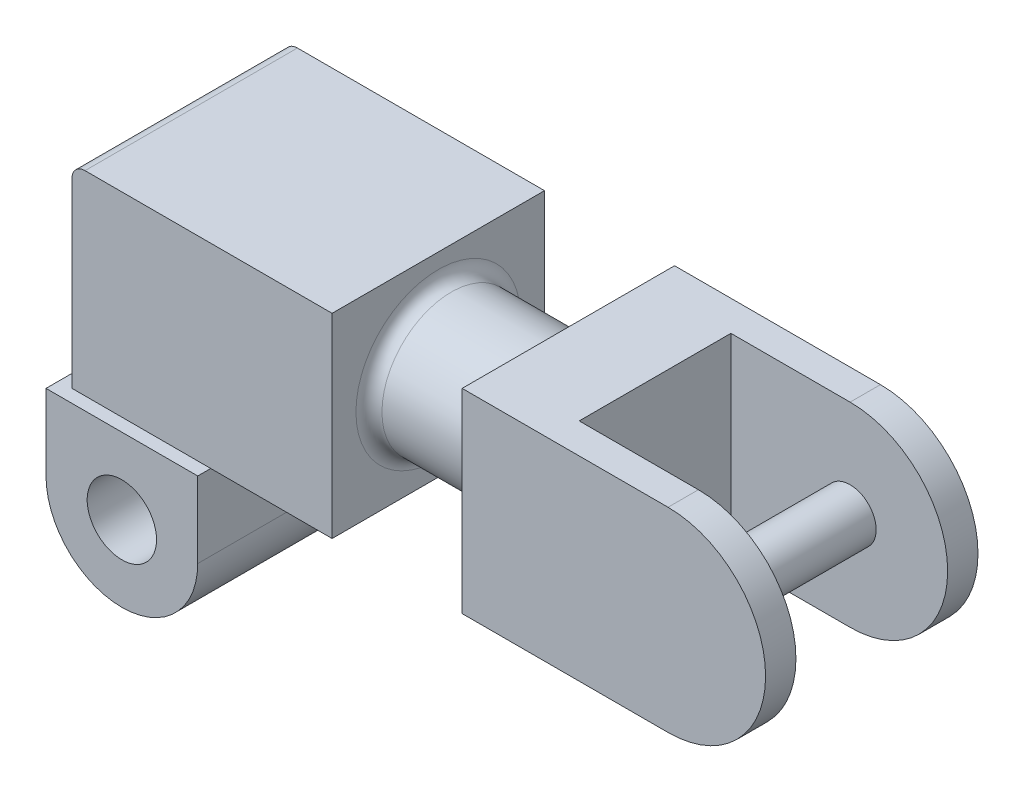
ISO-10303-21;
HEADER;
FILE_DESCRIPTION(('STEP AP214'),'2;1');
FILE_NAME('part.step','',(''),(''),'','','');
FILE_SCHEMA(('AUTOMOTIVE_DESIGN { 1 0 10303 214 1 1 1 1 }'));
ENDSEC;
DATA;
#1=APPLICATION_CONTEXT('core data for automotive mechanical design processes');
#2=APPLICATION_PROTOCOL_DEFINITION('international standard','automotive_design',2000,#1);
#3=PRODUCT_CONTEXT('',#1,'mechanical');
#4=PRODUCT('Part','Part','',(#3));
#5=PRODUCT_RELATED_PRODUCT_CATEGORY('part','',(#4));
#6=PRODUCT_DEFINITION_FORMATION('','',#4);
#7=PRODUCT_DEFINITION_CONTEXT('part definition',#1,'design');
#8=PRODUCT_DEFINITION('design','',#6,#7);
#9=PRODUCT_DEFINITION_SHAPE('','',#8);
#10=(LENGTH_UNIT() NAMED_UNIT(*) SI_UNIT(.MILLI.,.METRE.));
#11=(NAMED_UNIT(*) PLANE_ANGLE_UNIT() SI_UNIT($,.RADIAN.));
#12=(NAMED_UNIT(*) SI_UNIT($,.STERADIAN.) SOLID_ANGLE_UNIT());
#13=UNCERTAINTY_MEASURE_WITH_UNIT(LENGTH_MEASURE(1.E-05),#10,'distance_accuracy_value','');
#14=(GEOMETRIC_REPRESENTATION_CONTEXT(3) GLOBAL_UNCERTAINTY_ASSIGNED_CONTEXT((#13)) GLOBAL_UNIT_ASSIGNED_CONTEXT((#10,
#11,#12)) REPRESENTATION_CONTEXT('',''));
#15=CARTESIAN_POINT('',(0.,0.,0.));
#16=DIRECTION('',(0.,0.,1.));
#17=DIRECTION('',(1.,0.,0.));
#18=AXIS2_PLACEMENT_3D('',#15,#16,#17);
#19=CARTESIAN_POINT('',(123.,40.,-17.5));
#20=DIRECTION('',(0.,0.,-1.));
#21=DIRECTION('',(-1.,0.,0.));
#22=AXIS2_PLACEMENT_3D('',#19,#20,#21);
#23=CYLINDRICAL_SURFACE('',#22,22.5);
#24=DIRECTION('',(0.,0.,1.));
#25=VECTOR('',#24,1.);
#26=CARTESIAN_POINT('',(123.,62.5,-17.5));
#27=LINE('',#26,#25);
#28=CARTESIAN_POINT('',(123.,62.5,-17.5));
#29=VERTEX_POINT('',#28);
#30=CARTESIAN_POINT('',(123.,62.5,-24.5));
#31=VERTEX_POINT('',#30);
#32=EDGE_CURVE('E294',#29,#31,#27,.F.);
#33=ORIENTED_EDGE('',*,*,#32,.F.);
#34=CARTESIAN_POINT('',(123.,40.,-17.5));
#35=DIRECTION('',(0.,0.,1.));
#36=DIRECTION('',(1.,0.,0.));
#37=AXIS2_PLACEMENT_3D('',#34,#35,#36);
#38=CIRCLE('',#37,22.5);
#39=CARTESIAN_POINT('',(123.,17.5,-17.5));
#40=VERTEX_POINT('',#39);
#41=EDGE_CURVE('E299',#40,#29,#38,.T.);
#42=ORIENTED_EDGE('',*,*,#41,.F.);
#43=DIRECTION('',(0.,0.,-1.));
#44=VECTOR('',#43,1.);
#45=CARTESIAN_POINT('',(123.,17.5,0.));
#46=LINE('',#45,#44);
#47=CARTESIAN_POINT('',(123.,17.5,-24.5));
#48=VERTEX_POINT('',#47);
#49=EDGE_CURVE('E297',#48,#40,#46,.F.);
#50=ORIENTED_EDGE('',*,*,#49,.F.);
#51=CARTESIAN_POINT('',(123.,40.,-24.5));
#52=DIRECTION('',(0.,0.,-1.));
#53=DIRECTION('',(-1.,0.,0.));
#54=AXIS2_PLACEMENT_3D('',#51,#52,#53);
#55=CIRCLE('',#54,22.5);
#56=EDGE_CURVE('E301',#31,#48,#55,.T.);
#57=ORIENTED_EDGE('',*,*,#56,.F.);
#58=EDGE_LOOP('',(#33,#42,#50,#57));
#59=FACE_BOUND('',#58,.T.);
#60=ADVANCED_FACE('F36',(#59),#23,.T.);
#61=CARTESIAN_POINT('',(123.,40.,24.5));
#62=DIRECTION('',(0.,0.,-1.));
#63=DIRECTION('',(-1.,0.,0.));
#64=AXIS2_PLACEMENT_3D('',#61,#62,#63);
#65=CYLINDRICAL_SURFACE('',#64,22.5);
#66=DIRECTION('',(0.,0.,1.));
#67=VECTOR('',#66,1.);
#68=CARTESIAN_POINT('',(123.,62.5,24.5));
#69=LINE('',#68,#67);
#70=CARTESIAN_POINT('',(123.,62.5,24.5));
#71=VERTEX_POINT('',#70);
#72=CARTESIAN_POINT('',(123.,62.5,17.5));
#73=VERTEX_POINT('',#72);
#74=EDGE_CURVE('E286',#71,#73,#69,.F.);
#75=ORIENTED_EDGE('',*,*,#74,.F.);
#76=CARTESIAN_POINT('',(123.,40.,24.5));
#77=DIRECTION('',(0.,0.,1.));
#78=DIRECTION('',(1.,0.,0.));
#79=AXIS2_PLACEMENT_3D('',#76,#77,#78);
#80=CIRCLE('',#79,22.5);
#81=CARTESIAN_POINT('',(123.,17.5,24.5));
#82=VERTEX_POINT('',#81);
#83=EDGE_CURVE('E291',#82,#71,#80,.T.);
#84=ORIENTED_EDGE('',*,*,#83,.F.);
#85=DIRECTION('',(0.,0.,-1.));
#86=VECTOR('',#85,1.);
#87=CARTESIAN_POINT('',(123.,17.5,0.));
#88=LINE('',#87,#86);
#89=CARTESIAN_POINT('',(123.,17.5,17.5));
#90=VERTEX_POINT('',#89);
#91=EDGE_CURVE('E289',#90,#82,#88,.F.);
#92=ORIENTED_EDGE('',*,*,#91,.F.);
#93=CARTESIAN_POINT('',(123.,40.,17.5));
#94=DIRECTION('',(0.,0.,-1.));
#95=DIRECTION('',(-1.,0.,0.));
#96=AXIS2_PLACEMENT_3D('',#93,#94,#95);
#97=CIRCLE('',#96,22.5);
#98=EDGE_CURVE('E167',#73,#90,#97,.T.);
#99=ORIENTED_EDGE('',*,*,#98,.F.);
#100=EDGE_LOOP('',(#75,#84,#92,#99));
#101=FACE_BOUND('',#100,.T.);
#102=ADVANCED_FACE('F367',(#101),#65,.T.);
#103=CARTESIAN_POINT('',(-17.5,17.5,27.5));
#104=DIRECTION('',(0.,-1.,0.));
#105=DIRECTION('',(0.,0.,-1.));
#106=AXIS2_PLACEMENT_3D('',#103,#104,#105);
#107=PLANE('',#106);
#108=DIRECTION('',(-1.,0.,0.));
#109=VECTOR('',#108,1.);
#110=CARTESIAN_POINT('',(45.5,17.5,-24.5));
#111=LINE('',#110,#109);
#112=CARTESIAN_POINT('',(17.5,17.5,-24.5));
#113=VERTEX_POINT('',#112);
#114=CARTESIAN_POINT('',(-14.5,17.5,-24.5));
#115=VERTEX_POINT('',#114);
#116=EDGE_CURVE('E238',#113,#115,#111,.T.);
#117=ORIENTED_EDGE('',*,*,#116,.F.);
#118=DIRECTION('',(0.,0.,-1.));
#119=VECTOR('',#118,1.);
#120=CARTESIAN_POINT('',(17.5,17.5,27.5));
#121=LINE('',#120,#119);
#122=CARTESIAN_POINT('',(17.5,17.5,-27.5));
#123=VERTEX_POINT('',#122);
#124=EDGE_CURVE('E279',#113,#123,#121,.T.);
#125=ORIENTED_EDGE('',*,*,#124,.T.);
#126=DIRECTION('',(-1.,0.,0.));
#127=VECTOR('',#126,1.);
#128=CARTESIAN_POINT('',(-17.5,17.5,-27.5));
#129=LINE('',#128,#127);
#130=CARTESIAN_POINT('',(-17.5,17.5,-27.5));
#131=VERTEX_POINT('',#130);
#132=EDGE_CURVE('E271',#123,#131,#129,.T.);
#133=ORIENTED_EDGE('',*,*,#132,.T.);
#134=DIRECTION('',(0.,0.,-1.));
#135=VECTOR('',#134,1.);
#136=CARTESIAN_POINT('',(-17.5,17.5,27.5));
#137=LINE('',#136,#135);
#138=CARTESIAN_POINT('',(-17.5,17.5,27.5));
#139=VERTEX_POINT('',#138);
#140=EDGE_CURVE('E276',#139,#131,#137,.T.);
#141=ORIENTED_EDGE('',*,*,#140,.F.);
#142=DIRECTION('',(-1.,0.,0.));
#143=VECTOR('',#142,1.);
#144=CARTESIAN_POINT('',(-17.5,17.5,27.5));
#145=LINE('',#144,#143);
#146=CARTESIAN_POINT('',(17.5,17.5,27.5));
#147=VERTEX_POINT('',#146);
#148=EDGE_CURVE('E261',#147,#139,#145,.T.);
#149=ORIENTED_EDGE('',*,*,#148,.F.);
#150=CARTESIAN_POINT('',(17.5,17.5,24.5));
#151=VERTEX_POINT('',#150);
#152=EDGE_CURVE('E280',#147,#151,#121,.T.);
#153=ORIENTED_EDGE('',*,*,#152,.T.);
#154=DIRECTION('',(1.,0.,0.));
#155=VECTOR('',#154,1.);
#156=CARTESIAN_POINT('',(45.5,17.5,24.5));
#157=LINE('',#156,#155);
#158=CARTESIAN_POINT('',(-14.5,17.5,24.5));
#159=VERTEX_POINT('',#158);
#160=EDGE_CURVE('E231',#159,#151,#157,.T.);
#161=ORIENTED_EDGE('',*,*,#160,.F.);
#162=DIRECTION('',(0.,0.,1.));
#163=VECTOR('',#162,1.);
#164=CARTESIAN_POINT('',(-14.5,17.5,24.5));
#165=LINE('',#164,#163);
#166=EDGE_CURVE('E214',#115,#159,#165,.T.);
#167=ORIENTED_EDGE('',*,*,#166,.F.);
#168=EDGE_LOOP('',(#117,#125,#133,#141,#149,#153,#161,#167));
#169=FACE_BOUND('',#168,.T.);
#170=ADVANCED_FACE('F382',(#169),#107,.F.);
#171=CARTESIAN_POINT('',(0.,0.,27.5));
#172=DIRECTION('',(0.,0.,1.));
#173=DIRECTION('',(1.,0.,0.));
#174=AXIS2_PLACEMENT_3D('',#171,#172,#173);
#175=PLANE('',#174);
#176=CARTESIAN_POINT('',(0.,0.,27.5));
#177=DIRECTION('',(0.,0.,1.));
#178=DIRECTION('',(1.,0.,0.));
#179=AXIS2_PLACEMENT_3D('',#176,#177,#178);
#180=CIRCLE('',#179,17.5);
#181=CARTESIAN_POINT('',(-17.5,0.,27.5));
#182=VERTEX_POINT('',#181);
#183=CARTESIAN_POINT('',(17.5,0.,27.5));
#184=VERTEX_POINT('',#183);
#185=EDGE_CURVE('E255',#182,#184,#180,.T.);
#186=ORIENTED_EDGE('',*,*,#185,.T.);
#187=DIRECTION('',(0.,1.,0.));
#188=VECTOR('',#187,1.);
#189=CARTESIAN_POINT('',(17.5,17.5,27.5));
#190=LINE('',#189,#188);
#191=EDGE_CURVE('E258',#184,#147,#190,.T.);
#192=ORIENTED_EDGE('',*,*,#191,.T.);
#193=ORIENTED_EDGE('',*,*,#148,.T.);
#194=DIRECTION('',(0.,-1.,0.));
#195=VECTOR('',#194,1.);
#196=CARTESIAN_POINT('',(-17.5,0.,27.5));
#197=LINE('',#196,#195);
#198=EDGE_CURVE('E263',#139,#182,#197,.T.);
#199=ORIENTED_EDGE('',*,*,#198,.T.);
#200=EDGE_LOOP('',(#186,#192,#193,#199));
#201=FACE_BOUND('',#200,.T.);
#202=CARTESIAN_POINT('',(0.,0.,27.5));
#203=DIRECTION('',(0.,0.,1.));
#204=DIRECTION('',(1.,0.,0.));
#205=AXIS2_PLACEMENT_3D('',#202,#203,#204);
#206=CIRCLE('',#205,8.);
#207=CARTESIAN_POINT('',(8.,0.,27.5));
#208=VERTEX_POINT('',#207);
#209=EDGE_CURVE('E249',#208,#208,#206,.T.);
#210=ORIENTED_EDGE('',*,*,#209,.F.);
#211=EDGE_LOOP('',(#210));
#212=FACE_BOUND('',#211,.T.);
#213=ADVANCED_FACE('F437',(#201,#212),#175,.T.);
#214=CARTESIAN_POINT('',(0.,0.,-27.5));
#215=DIRECTION('',(0.,0.,1.));
#216=DIRECTION('',(1.,0.,0.));
#217=AXIS2_PLACEMENT_3D('',#214,#215,#216);
#218=PLANE('',#217);
#219=CARTESIAN_POINT('',(0.,0.,-27.5));
#220=DIRECTION('',(0.,0.,1.));
#221=DIRECTION('',(1.,0.,0.));
#222=AXIS2_PLACEMENT_3D('',#219,#220,#221);
#223=CIRCLE('',#222,17.5);
#224=CARTESIAN_POINT('',(-17.5,0.,-27.5));
#225=VERTEX_POINT('',#224);
#226=CARTESIAN_POINT('',(17.5,0.,-27.5));
#227=VERTEX_POINT('',#226);
#228=EDGE_CURVE('E252',#225,#227,#223,.T.);
#229=ORIENTED_EDGE('',*,*,#228,.F.);
#230=DIRECTION('',(0.,-1.,0.));
#231=VECTOR('',#230,1.);
#232=CARTESIAN_POINT('',(-17.5,0.,-27.5));
#233=LINE('',#232,#231);
#234=EDGE_CURVE('E259',#131,#225,#233,.T.);
#235=ORIENTED_EDGE('',*,*,#234,.F.);
#236=ORIENTED_EDGE('',*,*,#132,.F.);
#237=DIRECTION('',(0.,1.,0.));
#238=VECTOR('',#237,1.);
#239=CARTESIAN_POINT('',(17.5,17.5,-27.5));
#240=LINE('',#239,#238);
#241=EDGE_CURVE('E268',#227,#123,#240,.T.);
#242=ORIENTED_EDGE('',*,*,#241,.F.);
#243=EDGE_LOOP('',(#229,#235,#236,#242));
#244=FACE_BOUND('',#243,.T.);
#245=CARTESIAN_POINT('',(0.,0.,-27.5));
#246=DIRECTION('',(0.,0.,1.));
#247=DIRECTION('',(1.,0.,0.));
#248=AXIS2_PLACEMENT_3D('',#245,#246,#247);
#249=CIRCLE('',#248,8.);
#250=CARTESIAN_POINT('',(8.,0.,-27.5));
#251=VERTEX_POINT('',#250);
#252=EDGE_CURVE('E248',#251,#251,#249,.T.);
#253=ORIENTED_EDGE('',*,*,#252,.T.);
#254=EDGE_LOOP('',(#253));
#255=FACE_BOUND('',#254,.T.);
#256=ADVANCED_FACE('F427',(#244,#255),#218,.F.);
#257=CARTESIAN_POINT('',(0.,0.,27.5));
#258=DIRECTION('',(0.,0.,-1.));
#259=DIRECTION('',(-1.,0.,0.));
#260=AXIS2_PLACEMENT_3D('',#257,#258,#259);
#261=CYLINDRICAL_SURFACE('',#260,17.5);
#262=ORIENTED_EDGE('',*,*,#228,.T.);
#263=DIRECTION('',(0.,0.,-1.));
#264=VECTOR('',#263,1.);
#265=CARTESIAN_POINT('',(17.5,0.,27.5));
#266=LINE('',#265,#264);
#267=EDGE_CURVE('E282',#184,#227,#266,.T.);
#268=ORIENTED_EDGE('',*,*,#267,.F.);
#269=ORIENTED_EDGE('',*,*,#185,.F.);
#270=DIRECTION('',(0.,0.,-1.));
#271=VECTOR('',#270,1.);
#272=CARTESIAN_POINT('',(-17.5,0.,27.5));
#273=LINE('',#272,#271);
#274=EDGE_CURVE('E265',#182,#225,#273,.T.);
#275=ORIENTED_EDGE('',*,*,#274,.T.);
#276=EDGE_LOOP('',(#262,#268,#269,#275));
#277=FACE_BOUND('',#276,.T.);
#278=ADVANCED_FACE('F435',(#277),#261,.T.);
#279=CARTESIAN_POINT('',(17.5,17.5,27.5));
#280=DIRECTION('',(-1.,0.,0.));
#281=DIRECTION('',(0.,0.,1.));
#282=AXIS2_PLACEMENT_3D('',#279,#280,#281);
#283=PLANE('',#282);
#284=ORIENTED_EDGE('',*,*,#241,.T.);
#285=ORIENTED_EDGE('',*,*,#124,.F.);
#286=EDGE_CURVE('E283',#151,#113,#121,.T.);
#287=ORIENTED_EDGE('',*,*,#286,.F.);
#288=ORIENTED_EDGE('',*,*,#152,.F.);
#289=ORIENTED_EDGE('',*,*,#191,.F.);
#290=ORIENTED_EDGE('',*,*,#267,.T.);
#291=EDGE_LOOP('',(#284,#285,#287,#288,#289,#290));
#292=FACE_BOUND('',#291,.T.);
#293=ADVANCED_FACE('F422',(#292),#283,.F.);
#294=CARTESIAN_POINT('',(-17.5,0.,27.5));
#295=DIRECTION('',(1.,0.,0.));
#296=DIRECTION('',(0.,0.,-1.));
#297=AXIS2_PLACEMENT_3D('',#294,#295,#296);
#298=PLANE('',#297);
#299=ORIENTED_EDGE('',*,*,#234,.T.);
#300=ORIENTED_EDGE('',*,*,#274,.F.);
#301=ORIENTED_EDGE('',*,*,#198,.F.);
#302=ORIENTED_EDGE('',*,*,#140,.T.);
#303=EDGE_LOOP('',(#299,#300,#301,#302));
#304=FACE_BOUND('',#303,.T.);
#305=ADVANCED_FACE('F431',(#304),#298,.F.);
#306=CARTESIAN_POINT('',(0.,0.,27.5));
#307=DIRECTION('',(0.,0.,-1.));
#308=DIRECTION('',(-1.,0.,0.));
#309=AXIS2_PLACEMENT_3D('',#306,#307,#308);
#310=CYLINDRICAL_SURFACE('',#309,8.);
#311=ORIENTED_EDGE('',*,*,#209,.T.);
#312=EDGE_LOOP('',(#311));
#313=FACE_BOUND('',#312,.T.);
#314=ORIENTED_EDGE('',*,*,#252,.F.);
#315=EDGE_LOOP('',(#314));
#316=FACE_BOUND('',#315,.T.);
#317=ADVANCED_FACE('F454',(#313,#316),#310,.F.);
#318=CARTESIAN_POINT('',(0.,17.5,0.));
#319=DIRECTION('',(0.,1.,0.));
#320=DIRECTION('',(0.,0.,1.));
#321=AXIS2_PLACEMENT_3D('',#318,#319,#320);
#322=PLANE('',#321);
#323=CARTESIAN_POINT('',(45.5,17.5,24.5));
#324=VERTEX_POINT('',#323);
#325=EDGE_CURVE('E230',#151,#324,#157,.T.);
#326=ORIENTED_EDGE('',*,*,#325,.F.);
#327=ORIENTED_EDGE('',*,*,#286,.T.);
#328=CARTESIAN_POINT('',(45.5,17.5,-24.5));
#329=VERTEX_POINT('',#328);
#330=EDGE_CURVE('E222',#329,#113,#111,.T.);
#331=ORIENTED_EDGE('',*,*,#330,.F.);
#332=DIRECTION('',(0.,0.,-1.));
#333=VECTOR('',#332,1.);
#334=CARTESIAN_POINT('',(45.5,17.5,24.5));
#335=LINE('',#334,#333);
#336=EDGE_CURVE('E234',#324,#329,#335,.T.);
#337=ORIENTED_EDGE('',*,*,#336,.F.);
#338=EDGE_LOOP('',(#326,#327,#331,#337));
#339=FACE_BOUND('',#338,.T.);
#340=ADVANCED_FACE('F413',(#339),#322,.F.);
#341=CARTESIAN_POINT('',(-14.5,62.5,24.5));
#342=DIRECTION('',(1.,0.,0.));
#343=DIRECTION('',(0.,0.,-1.));
#344=AXIS2_PLACEMENT_3D('',#341,#342,#343);
#345=PLANE('',#344);
#346=DIRECTION('',(0.,-1.,0.));
#347=VECTOR('',#346,1.);
#348=CARTESIAN_POINT('',(-14.5,62.5,24.5));
#349=LINE('',#348,#347);
#350=CARTESIAN_POINT('',(-14.5,59.5,24.5));
#351=VERTEX_POINT('',#350);
#352=EDGE_CURVE('E246',#351,#159,#349,.T.);
#353=ORIENTED_EDGE('',*,*,#352,.F.);
#354=DIRECTION('',(0.,0.,1.));
#355=VECTOR('',#354,1.);
#356=CARTESIAN_POINT('',(-14.5,59.5,-24.5));
#357=LINE('',#356,#355);
#358=CARTESIAN_POINT('',(-14.5,59.5,-24.5));
#359=VERTEX_POINT('',#358);
#360=EDGE_CURVE('E51',#351,#359,#357,.F.);
#361=ORIENTED_EDGE('',*,*,#360,.T.);
#362=DIRECTION('',(0.,-1.,0.));
#363=VECTOR('',#362,1.);
#364=CARTESIAN_POINT('',(-14.5,62.5,-24.5));
#365=LINE('',#364,#363);
#366=EDGE_CURVE('E227',#359,#115,#365,.T.);
#367=ORIENTED_EDGE('',*,*,#366,.T.);
#368=ORIENTED_EDGE('',*,*,#166,.T.);
#369=EDGE_LOOP('',(#353,#361,#367,#368));
#370=FACE_BOUND('',#369,.T.);
#371=ADVANCED_FACE('F441',(#370),#345,.F.);
#372=CARTESIAN_POINT('',(45.5,62.5,24.5));
#373=DIRECTION('',(0.,0.,-1.));
#374=DIRECTION('',(-1.,0.,0.));
#375=AXIS2_PLACEMENT_3D('',#372,#373,#374);
#376=PLANE('',#375);
#377=DIRECTION('',(1.,0.,0.));
#378=VECTOR('',#377,1.);
#379=CARTESIAN_POINT('',(45.5,62.5,24.5));
#380=LINE('',#379,#378);
#381=CARTESIAN_POINT('',(-11.5,62.5,24.5));
#382=VERTEX_POINT('',#381);
#383=CARTESIAN_POINT('',(45.5,62.5,24.5));
#384=VERTEX_POINT('',#383);
#385=EDGE_CURVE('E219',#382,#384,#380,.T.);
#386=ORIENTED_EDGE('',*,*,#385,.F.);
#387=CARTESIAN_POINT('',(-11.5,59.5,24.5));
#388=DIRECTION('',(0.,0.,-1.));
#389=DIRECTION('',(-1.,0.,0.));
#390=AXIS2_PLACEMENT_3D('',#387,#388,#389);
#391=CIRCLE('',#390,3.);
#392=EDGE_CURVE('E59',#382,#351,#391,.F.);
#393=ORIENTED_EDGE('',*,*,#392,.T.);
#394=ORIENTED_EDGE('',*,*,#352,.T.);
#395=ORIENTED_EDGE('',*,*,#160,.T.);
#396=ORIENTED_EDGE('',*,*,#325,.T.);
#397=DIRECTION('',(0.,-1.,0.));
#398=VECTOR('',#397,1.);
#399=CARTESIAN_POINT('',(45.5,62.5,24.5));
#400=LINE('',#399,#398);
#401=EDGE_CURVE('E243',#384,#324,#400,.T.);
#402=ORIENTED_EDGE('',*,*,#401,.F.);
#403=EDGE_LOOP('',(#386,#393,#394,#395,#396,#402));
#404=FACE_BOUND('',#403,.T.);
#405=ADVANCED_FACE('F442',(#404),#376,.F.);
#406=CARTESIAN_POINT('',(45.5,62.5,24.5));
#407=DIRECTION('',(-1.,0.,0.));
#408=DIRECTION('',(0.,0.,1.));
#409=AXIS2_PLACEMENT_3D('',#406,#407,#408);
#410=PLANE('',#409);
#411=CARTESIAN_POINT('',(45.5,40.,0.));
#412=DIRECTION('',(-1.,0.,0.));
#413=DIRECTION('',(0.,0.,1.));
#414=AXIS2_PLACEMENT_3D('',#411,#412,#413);
#415=CIRCLE('',#414,19.);
#416=CARTESIAN_POINT('',(45.5,40.,19.));
#417=VERTEX_POINT('',#416);
#418=EDGE_CURVE('E11',#417,#417,#415,.T.);
#419=ORIENTED_EDGE('',*,*,#418,.T.);
#420=EDGE_LOOP('',(#419));
#421=FACE_BOUND('',#420,.T.);
#422=ORIENTED_EDGE('',*,*,#336,.T.);
#423=DIRECTION('',(0.,-1.,0.));
#424=VECTOR('',#423,1.);
#425=CARTESIAN_POINT('',(45.5,62.5,-24.5));
#426=LINE('',#425,#424);
#427=CARTESIAN_POINT('',(45.5,62.5,-24.5));
#428=VERTEX_POINT('',#427);
#429=EDGE_CURVE('E240',#428,#329,#426,.T.);
#430=ORIENTED_EDGE('',*,*,#429,.F.);
#431=DIRECTION('',(0.,0.,-1.));
#432=VECTOR('',#431,1.);
#433=CARTESIAN_POINT('',(45.5,62.5,24.5));
#434=LINE('',#433,#432);
#435=EDGE_CURVE('E221',#384,#428,#434,.T.);
#436=ORIENTED_EDGE('',*,*,#435,.F.);
#437=ORIENTED_EDGE('',*,*,#401,.T.);
#438=EDGE_LOOP('',(#422,#430,#436,#437));
#439=FACE_BOUND('',#438,.T.);
#440=ADVANCED_FACE('F407',(#421,#439),#410,.F.);
#441=CARTESIAN_POINT('',(45.5,62.5,-24.5));
#442=DIRECTION('',(0.,0.,1.));
#443=DIRECTION('',(1.,0.,0.));
#444=AXIS2_PLACEMENT_3D('',#441,#442,#443);
#445=PLANE('',#444);
#446=ORIENTED_EDGE('',*,*,#366,.F.);
#447=CARTESIAN_POINT('',(-11.5,59.5,-24.5));
#448=DIRECTION('',(0.,0.,1.));
#449=DIRECTION('',(1.,0.,0.));
#450=AXIS2_PLACEMENT_3D('',#447,#448,#449);
#451=CIRCLE('',#450,3.);
#452=CARTESIAN_POINT('',(-11.5,62.5,-24.5));
#453=VERTEX_POINT('',#452);
#454=EDGE_CURVE('E308',#359,#453,#451,.F.);
#455=ORIENTED_EDGE('',*,*,#454,.T.);
#456=DIRECTION('',(-1.,0.,0.));
#457=VECTOR('',#456,1.);
#458=CARTESIAN_POINT('',(45.5,62.5,-24.5));
#459=LINE('',#458,#457);
#460=EDGE_CURVE('E224',#428,#453,#459,.T.);
#461=ORIENTED_EDGE('',*,*,#460,.F.);
#462=ORIENTED_EDGE('',*,*,#429,.T.);
#463=ORIENTED_EDGE('',*,*,#330,.T.);
#464=ORIENTED_EDGE('',*,*,#116,.T.);
#465=EDGE_LOOP('',(#446,#455,#461,#462,#463,#464));
#466=FACE_BOUND('',#465,.T.);
#467=ADVANCED_FACE('F400',(#466),#445,.F.);
#468=CARTESIAN_POINT('',(0.,62.5,0.));
#469=DIRECTION('',(0.,1.,0.));
#470=DIRECTION('',(0.,0.,1.));
#471=AXIS2_PLACEMENT_3D('',#468,#469,#470);
#472=PLANE('',#471);
#473=ORIENTED_EDGE('',*,*,#460,.T.);
#474=DIRECTION('',(0.,0.,1.));
#475=VECTOR('',#474,1.);
#476=CARTESIAN_POINT('',(-11.5,62.5,24.5));
#477=LINE('',#476,#475);
#478=EDGE_CURVE('E303',#453,#382,#477,.T.);
#479=ORIENTED_EDGE('',*,*,#478,.T.);
#480=ORIENTED_EDGE('',*,*,#385,.T.);
#481=ORIENTED_EDGE('',*,*,#435,.T.);
#482=EDGE_LOOP('',(#473,#479,#480,#481));
#483=FACE_BOUND('',#482,.T.);
#484=ADVANCED_FACE('F373',(#483),#472,.T.);
#485=CARTESIAN_POINT('',(75.5,40.,0.));
#486=DIRECTION('',(-1.,0.,0.));
#487=DIRECTION('',(0.,0.,1.));
#488=AXIS2_PLACEMENT_3D('',#485,#486,#487);
#489=CYLINDRICAL_SURFACE('',#488,16.);
#490=CARTESIAN_POINT('',(72.5,40.,0.));
#491=DIRECTION('',(-1.,0.,0.));
#492=DIRECTION('',(0.,0.,1.));
#493=AXIS2_PLACEMENT_3D('',#490,#491,#492);
#494=CIRCLE('',#493,16.);
#495=CARTESIAN_POINT('',(72.5,40.,16.));
#496=VERTEX_POINT('',#495);
#497=EDGE_CURVE('E44',#496,#496,#494,.T.);
#498=CARTESIAN_POINT('',(48.5,40.,0.));
#499=DIRECTION('',(-1.,0.,0.));
#500=DIRECTION('',(0.,0.,1.));
#501=AXIS2_PLACEMENT_3D('',#498,#499,#500);
#502=CIRCLE('',#501,16.);
#503=CARTESIAN_POINT('',(48.5,40.,16.));
#504=VERTEX_POINT('',#503);
#505=EDGE_CURVE('E313',#504,#504,#502,.F.);
#506=CARTESIAN_POINT('',(72.5,40.,16.));
#507=CARTESIAN_POINT('',(72.25,40.,16.));
#508=CARTESIAN_POINT('',(72.,40.,16.));
#509=CARTESIAN_POINT('',(71.5,40.,16.));
#510=CARTESIAN_POINT('',(71.25,40.,16.));
#511=CARTESIAN_POINT('',(70.75,40.,16.));
#512=CARTESIAN_POINT('',(70.5,40.,16.));
#513=CARTESIAN_POINT('',(70.,40.,16.));
#514=CARTESIAN_POINT('',(69.75,40.,16.));
#515=CARTESIAN_POINT('',(69.25,40.,16.));
#516=CARTESIAN_POINT('',(69.,40.,16.));
#517=CARTESIAN_POINT('',(68.5,40.,16.));
#518=CARTESIAN_POINT('',(68.25,40.,16.));
#519=CARTESIAN_POINT('',(67.75,40.,16.));
#520=CARTESIAN_POINT('',(67.5,40.,16.));
#521=CARTESIAN_POINT('',(67.,40.,16.));
#522=CARTESIAN_POINT('',(66.75,40.,16.));
#523=CARTESIAN_POINT('',(66.25,40.,16.));
#524=CARTESIAN_POINT('',(66.,40.,16.));
#525=CARTESIAN_POINT('',(65.5,40.,16.));
#526=CARTESIAN_POINT('',(65.25,40.,16.));
#527=CARTESIAN_POINT('',(64.75,40.,16.));
#528=CARTESIAN_POINT('',(64.5,40.,16.));
#529=CARTESIAN_POINT('',(64.,40.,16.));
#530=CARTESIAN_POINT('',(63.75,40.,16.));
#531=CARTESIAN_POINT('',(63.25,40.,16.));
#532=CARTESIAN_POINT('',(63.,40.,16.));
#533=CARTESIAN_POINT('',(62.5,40.,16.));
#534=CARTESIAN_POINT('',(62.25,40.,16.));
#535=CARTESIAN_POINT('',(61.75,40.,16.));
#536=CARTESIAN_POINT('',(61.5,40.,16.));
#537=CARTESIAN_POINT('',(61.,40.,16.));
#538=CARTESIAN_POINT('',(60.75,40.,16.));
#539=CARTESIAN_POINT('',(60.25,40.,16.));
#540=CARTESIAN_POINT('',(60.,40.,16.));
#541=CARTESIAN_POINT('',(59.5,40.,16.));
#542=CARTESIAN_POINT('',(59.25,40.,16.));
#543=CARTESIAN_POINT('',(58.75,40.,16.));
#544=CARTESIAN_POINT('',(58.5,40.,16.));
#545=CARTESIAN_POINT('',(58.,40.,16.));
#546=CARTESIAN_POINT('',(57.75,40.,16.));
#547=CARTESIAN_POINT('',(57.25,40.,16.));
#548=CARTESIAN_POINT('',(57.,40.,16.));
#549=CARTESIAN_POINT('',(56.5,40.,16.));
#550=CARTESIAN_POINT('',(56.25,40.,16.));
#551=CARTESIAN_POINT('',(55.75,40.,16.));
#552=CARTESIAN_POINT('',(55.5,40.,16.));
#553=CARTESIAN_POINT('',(55.,40.,16.));
#554=CARTESIAN_POINT('',(54.75,40.,16.));
#555=CARTESIAN_POINT('',(54.25,40.,16.));
#556=CARTESIAN_POINT('',(54.,40.,16.));
#557=CARTESIAN_POINT('',(53.5,40.,16.));
#558=CARTESIAN_POINT('',(53.25,40.,16.));
#559=CARTESIAN_POINT('',(52.75,40.,16.));
#560=CARTESIAN_POINT('',(52.5,40.,16.));
#561=CARTESIAN_POINT('',(52.,40.,16.));
#562=CARTESIAN_POINT('',(51.75,40.,16.));
#563=CARTESIAN_POINT('',(51.25,40.,16.));
#564=CARTESIAN_POINT('',(51.,40.,16.));
#565=CARTESIAN_POINT('',(50.5,40.,16.));
#566=CARTESIAN_POINT('',(50.25,40.,16.));
#567=CARTESIAN_POINT('',(49.75,40.,16.));
#568=CARTESIAN_POINT('',(49.5,40.,16.));
#569=CARTESIAN_POINT('',(49.,40.,16.));
#570=CARTESIAN_POINT('',(48.75,40.,16.));
#571=CARTESIAN_POINT('',(48.5,40.,16.));
#572=B_SPLINE_CURVE_WITH_KNOTS('',3,(#506,#507,#508,#509,#510,#511,#512,#513,#514,#515,#516,
#517,#518,#519,#520,#521,#522,#523,#524,#525,#526,#527,#528,#529,#530,#531,#532,#533,#534,#535,
#536,#537,#538,#539,#540,#541,#542,#543,#544,#545,#546,#547,#548,#549,#550,#551,#552,#553,#554,
#555,#556,#557,#558,#559,#560,#561,#562,#563,#564,#565,#566,#567,#568,#569,#570,#571),
.UNSPECIFIED.,.F.,.F.,(4,2,2,2,2,2,2,2,2,2,2,2,2,2,2,2,2,2,2,2,2,2,2,2,2,2,2,2,2,2,2,2,4),(0.,
0.750000000000001,1.5,2.25,3.,3.75,4.5,5.25,6.00000000000001,6.75000000000001,7.50000000000001,
8.25000000000001,9.00000000000001,9.75000000000001,10.5,11.25,12.,12.75,13.5,14.25,15.,15.75,
16.5,17.25,18.,18.75,19.5,20.25,21.,21.75,22.5,23.25,24.),.UNSPECIFIED.);
#573=EDGE_CURVE('BSEAM318',#496,#504,#572,.T.);
#574=ORIENTED_EDGE('',*,*,#497,.T.);
#575=ORIENTED_EDGE('',*,*,#505,.T.);
#576=ORIENTED_EDGE('',*,*,#573,.T.);
#577=ORIENTED_EDGE('',*,*,#573,.F.);
#578=EDGE_LOOP('',(#574,#576,#575,#577));
#579=FACE_BOUND('',#578,.T.);
#580=ADVANCED_FACE('F318',(#579),#489,.T.);
#581=CARTESIAN_POINT('',(145.5,17.5,24.5));
#582=DIRECTION('',(0.,0.,1.));
#583=DIRECTION('',(1.,0.,0.));
#584=AXIS2_PLACEMENT_3D('',#581,#582,#583);
#585=PLANE('',#584);
#586=DIRECTION('',(1.,0.,0.));
#587=VECTOR('',#586,1.);
#588=CARTESIAN_POINT('',(145.5,17.5,24.5));
#589=LINE('',#588,#587);
#590=CARTESIAN_POINT('',(75.5,17.5,24.5));
#591=VERTEX_POINT('',#590);
#592=EDGE_CURVE('E173',#591,#82,#589,.T.);
#593=ORIENTED_EDGE('',*,*,#592,.T.);
#594=ORIENTED_EDGE('',*,*,#83,.T.);
#595=DIRECTION('',(1.,0.,0.));
#596=VECTOR('',#595,1.);
#597=CARTESIAN_POINT('',(145.5,62.5,24.5));
#598=LINE('',#597,#596);
#599=CARTESIAN_POINT('',(75.5,62.5,24.5));
#600=VERTEX_POINT('',#599);
#601=EDGE_CURVE('E197',#600,#71,#598,.T.);
#602=ORIENTED_EDGE('',*,*,#601,.F.);
#603=DIRECTION('',(0.,1.,0.));
#604=VECTOR('',#603,1.);
#605=CARTESIAN_POINT('',(75.5,17.5,24.5));
#606=LINE('',#605,#604);
#607=EDGE_CURVE('E212',#591,#600,#606,.T.);
#608=ORIENTED_EDGE('',*,*,#607,.F.);
#609=EDGE_LOOP('',(#593,#594,#602,#608));
#610=FACE_BOUND('',#609,.T.);
#611=ADVANCED_FACE('F331',(#610),#585,.T.);
#612=CARTESIAN_POINT('',(75.5,17.5,24.5));
#613=DIRECTION('',(-1.,0.,0.));
#614=DIRECTION('',(0.,0.,1.));
#615=AXIS2_PLACEMENT_3D('',#612,#613,#614);
#616=PLANE('',#615);
#617=CARTESIAN_POINT('',(75.5,40.,0.));
#618=DIRECTION('',(-1.,0.,0.));
#619=DIRECTION('',(0.,0.,1.));
#620=AXIS2_PLACEMENT_3D('',#617,#618,#619);
#621=CIRCLE('',#620,19.);
#622=CARTESIAN_POINT('',(75.5,40.,19.));
#623=VERTEX_POINT('',#622);
#624=EDGE_CURVE('E310',#623,#623,#621,.F.);
#625=ORIENTED_EDGE('',*,*,#624,.T.);
#626=EDGE_LOOP('',(#625));
#627=FACE_BOUND('',#626,.T.);
#628=DIRECTION('',(0.,0.,1.));
#629=VECTOR('',#628,1.);
#630=CARTESIAN_POINT('',(75.5,62.5,24.5));
#631=LINE('',#630,#629);
#632=CARTESIAN_POINT('',(75.5,62.5,-24.5));
#633=VERTEX_POINT('',#632);
#634=EDGE_CURVE('E209',#633,#600,#631,.T.);
#635=ORIENTED_EDGE('',*,*,#634,.F.);
#636=DIRECTION('',(0.,1.,0.));
#637=VECTOR('',#636,1.);
#638=CARTESIAN_POINT('',(75.5,17.5,-24.5));
#639=LINE('',#638,#637);
#640=CARTESIAN_POINT('',(75.5,17.5,-24.5));
#641=VERTEX_POINT('',#640);
#642=EDGE_CURVE('E215',#641,#633,#639,.T.);
#643=ORIENTED_EDGE('',*,*,#642,.F.);
#644=DIRECTION('',(0.,0.,1.));
#645=VECTOR('',#644,1.);
#646=CARTESIAN_POINT('',(75.5,17.5,24.5));
#647=LINE('',#646,#645);
#648=EDGE_CURVE('E181',#641,#591,#647,.T.);
#649=ORIENTED_EDGE('',*,*,#648,.T.);
#650=ORIENTED_EDGE('',*,*,#607,.T.);
#651=EDGE_LOOP('',(#635,#643,#649,#650));
#652=FACE_BOUND('',#651,.T.);
#653=ADVANCED_FACE('F327',(#627,#652),#616,.T.);
#654=CARTESIAN_POINT('',(75.5,17.5,-24.5));
#655=DIRECTION('',(0.,0.,-1.));
#656=DIRECTION('',(-1.,0.,0.));
#657=AXIS2_PLACEMENT_3D('',#654,#655,#656);
#658=PLANE('',#657);
#659=DIRECTION('',(-1.,0.,0.));
#660=VECTOR('',#659,1.);
#661=CARTESIAN_POINT('',(75.5,62.5,-24.5));
#662=LINE('',#661,#660);
#663=EDGE_CURVE('E207',#31,#633,#662,.T.);
#664=ORIENTED_EDGE('',*,*,#663,.F.);
#665=ORIENTED_EDGE('',*,*,#56,.T.);
#666=DIRECTION('',(-1.,0.,0.));
#667=VECTOR('',#666,1.);
#668=CARTESIAN_POINT('',(75.5,17.5,-24.5));
#669=LINE('',#668,#667);
#670=EDGE_CURVE('E190',#48,#641,#669,.T.);
#671=ORIENTED_EDGE('',*,*,#670,.T.);
#672=ORIENTED_EDGE('',*,*,#642,.T.);
#673=EDGE_LOOP('',(#664,#665,#671,#672));
#674=FACE_BOUND('',#673,.T.);
#675=ADVANCED_FACE('F330',(#674),#658,.T.);
#676=CARTESIAN_POINT('',(145.5,17.5,-17.5));
#677=DIRECTION('',(0.,0.,1.));
#678=DIRECTION('',(1.,0.,0.));
#679=AXIS2_PLACEMENT_3D('',#676,#677,#678);
#680=PLANE('',#679);
#681=CARTESIAN_POINT('',(123.,40.,-17.5));
#682=DIRECTION('',(0.,0.,1.));
#683=DIRECTION('',(1.,0.,0.));
#684=AXIS2_PLACEMENT_3D('',#681,#682,#683);
#685=CIRCLE('',#684,6.00000000000002);
#686=CARTESIAN_POINT('',(129.,40.,-17.5));
#687=VERTEX_POINT('',#686);
#688=EDGE_CURVE('E347',#687,#687,#685,.T.);
#689=ORIENTED_EDGE('',*,*,#688,.F.);
#690=EDGE_LOOP('',(#689));
#691=FACE_BOUND('',#690,.T.);
#692=DIRECTION('',(1.,0.,0.));
#693=VECTOR('',#692,1.);
#694=CARTESIAN_POINT('',(145.5,17.5,-17.5));
#695=LINE('',#694,#693);
#696=CARTESIAN_POINT('',(95.5,17.5,-17.5));
#697=VERTEX_POINT('',#696);
#698=EDGE_CURVE('E188',#697,#40,#695,.T.);
#699=ORIENTED_EDGE('',*,*,#698,.T.);
#700=ORIENTED_EDGE('',*,*,#41,.T.);
#701=DIRECTION('',(1.,0.,0.));
#702=VECTOR('',#701,1.);
#703=CARTESIAN_POINT('',(145.5,62.5,-17.5));
#704=LINE('',#703,#702);
#705=CARTESIAN_POINT('',(95.5,62.5,-17.5));
#706=VERTEX_POINT('',#705);
#707=EDGE_CURVE('E204',#706,#29,#704,.T.);
#708=ORIENTED_EDGE('',*,*,#707,.F.);
#709=DIRECTION('',(0.,1.,0.));
#710=VECTOR('',#709,1.);
#711=CARTESIAN_POINT('',(95.5,17.5,-17.5));
#712=LINE('',#711,#710);
#713=EDGE_CURVE('E180',#697,#706,#712,.T.);
#714=ORIENTED_EDGE('',*,*,#713,.F.);
#715=EDGE_LOOP('',(#699,#700,#708,#714));
#716=FACE_BOUND('',#715,.T.);
#717=ADVANCED_FACE('F360',(#691,#716),#680,.T.);
#718=CARTESIAN_POINT('',(95.5,17.5,-17.5));
#719=DIRECTION('',(1.,0.,0.));
#720=DIRECTION('',(0.,0.,-1.));
#721=AXIS2_PLACEMENT_3D('',#718,#719,#720);
#722=PLANE('',#721);
#723=DIRECTION('',(0.,0.,-1.));
#724=VECTOR('',#723,1.);
#725=CARTESIAN_POINT('',(95.5,62.5,-17.5));
#726=LINE('',#725,#724);
#727=CARTESIAN_POINT('',(95.5,62.5,17.5));
#728=VERTEX_POINT('',#727);
#729=EDGE_CURVE('E179',#728,#706,#726,.T.);
#730=ORIENTED_EDGE('',*,*,#729,.F.);
#731=DIRECTION('',(0.,1.,0.));
#732=VECTOR('',#731,1.);
#733=CARTESIAN_POINT('',(95.5,17.5,17.5));
#734=LINE('',#733,#732);
#735=CARTESIAN_POINT('',(95.5,17.5,17.5));
#736=VERTEX_POINT('',#735);
#737=EDGE_CURVE('E165',#736,#728,#734,.T.);
#738=ORIENTED_EDGE('',*,*,#737,.F.);
#739=DIRECTION('',(0.,0.,-1.));
#740=VECTOR('',#739,1.);
#741=CARTESIAN_POINT('',(95.5,17.5,-17.5));
#742=LINE('',#741,#740);
#743=EDGE_CURVE('E172',#736,#697,#742,.T.);
#744=ORIENTED_EDGE('',*,*,#743,.T.);
#745=ORIENTED_EDGE('',*,*,#713,.T.);
#746=EDGE_LOOP('',(#730,#738,#744,#745));
#747=FACE_BOUND('',#746,.T.);
#748=ADVANCED_FACE('F177',(#747),#722,.T.);
#749=CARTESIAN_POINT('',(95.5,17.5,17.5));
#750=DIRECTION('',(0.,0.,-1.));
#751=DIRECTION('',(-1.,0.,0.));
#752=AXIS2_PLACEMENT_3D('',#749,#750,#751);
#753=PLANE('',#752);
#754=CARTESIAN_POINT('',(123.,40.,17.5));
#755=DIRECTION('',(0.,0.,1.));
#756=DIRECTION('',(1.,0.,0.));
#757=AXIS2_PLACEMENT_3D('',#754,#755,#756);
#758=CIRCLE('',#757,6.00000000000002);
#759=CARTESIAN_POINT('',(129.,40.,17.5));
#760=VERTEX_POINT('',#759);
#761=EDGE_CURVE('E201',#760,#760,#758,.T.);
#762=ORIENTED_EDGE('',*,*,#761,.T.);
#763=EDGE_LOOP('',(#762));
#764=FACE_BOUND('',#763,.T.);
#765=DIRECTION('',(-1.,0.,0.));
#766=VECTOR('',#765,1.);
#767=CARTESIAN_POINT('',(95.5,62.5,17.5));
#768=LINE('',#767,#766);
#769=EDGE_CURVE('E200',#73,#728,#768,.T.);
#770=ORIENTED_EDGE('',*,*,#769,.F.);
#771=ORIENTED_EDGE('',*,*,#98,.T.);
#772=DIRECTION('',(-1.,0.,0.));
#773=VECTOR('',#772,1.);
#774=CARTESIAN_POINT('',(95.5,17.5,17.5));
#775=LINE('',#774,#773);
#776=EDGE_CURVE('E161',#90,#736,#775,.T.);
#777=ORIENTED_EDGE('',*,*,#776,.T.);
#778=ORIENTED_EDGE('',*,*,#737,.T.);
#779=EDGE_LOOP('',(#770,#771,#777,#778));
#780=FACE_BOUND('',#779,.T.);
#781=ADVANCED_FACE('F164',(#764,#780),#753,.T.);
#782=CARTESIAN_POINT('',(0.,17.5,0.));
#783=DIRECTION('',(0.,-1.,0.));
#784=DIRECTION('',(0.,0.,-1.));
#785=AXIS2_PLACEMENT_3D('',#782,#783,#784);
#786=PLANE('',#785);
#787=ORIENTED_EDGE('',*,*,#670,.F.);
#788=ORIENTED_EDGE('',*,*,#49,.T.);
#789=ORIENTED_EDGE('',*,*,#698,.F.);
#790=ORIENTED_EDGE('',*,*,#743,.F.);
#791=ORIENTED_EDGE('',*,*,#776,.F.);
#792=ORIENTED_EDGE('',*,*,#91,.T.);
#793=ORIENTED_EDGE('',*,*,#592,.F.);
#794=ORIENTED_EDGE('',*,*,#648,.F.);
#795=EDGE_LOOP('',(#787,#788,#789,#790,#791,#792,#793,#794));
#796=FACE_BOUND('',#795,.T.);
#797=ADVANCED_FACE('F185',(#796),#786,.T.);
#798=CARTESIAN_POINT('',(0.,62.5,0.));
#799=DIRECTION('',(0.,-1.,0.));
#800=DIRECTION('',(0.,0.,-1.));
#801=AXIS2_PLACEMENT_3D('',#798,#799,#800);
#802=PLANE('',#801);
#803=ORIENTED_EDGE('',*,*,#707,.T.);
#804=ORIENTED_EDGE('',*,*,#32,.T.);
#805=ORIENTED_EDGE('',*,*,#663,.T.);
#806=ORIENTED_EDGE('',*,*,#634,.T.);
#807=ORIENTED_EDGE('',*,*,#601,.T.);
#808=ORIENTED_EDGE('',*,*,#74,.T.);
#809=ORIENTED_EDGE('',*,*,#769,.T.);
#810=ORIENTED_EDGE('',*,*,#729,.T.);
#811=EDGE_LOOP('',(#803,#804,#805,#806,#807,#808,#809,#810));
#812=FACE_BOUND('',#811,.T.);
#813=ADVANCED_FACE('F338',(#812),#802,.F.);
#814=CARTESIAN_POINT('',(-11.5,59.5,0.));
#815=DIRECTION('',(0.,0.,-1.));
#816=DIRECTION('',(-1.,0.,0.));
#817=AXIS2_PLACEMENT_3D('',#814,#815,#816);
#818=CYLINDRICAL_SURFACE('',#817,3.);
#819=ORIENTED_EDGE('',*,*,#454,.F.);
#820=ORIENTED_EDGE('',*,*,#360,.F.);
#821=ORIENTED_EDGE('',*,*,#392,.F.);
#822=ORIENTED_EDGE('',*,*,#478,.F.);
#823=EDGE_LOOP('',(#819,#820,#821,#822));
#824=FACE_BOUND('',#823,.T.);
#825=ADVANCED_FACE('F324',(#824),#818,.T.);
#826=CARTESIAN_POINT('',(72.5,40.,0.));
#827=DIRECTION('',(-1.,0.,0.));
#828=DIRECTION('',(0.,0.,1.));
#829=AXIS2_PLACEMENT_3D('',#826,#827,#828);
#830=TOROIDAL_SURFACE('',#829,19.,3.);
#831=ORIENTED_EDGE('',*,*,#497,.F.);
#832=EDGE_LOOP('',(#831));
#833=FACE_BOUND('',#832,.T.);
#834=ORIENTED_EDGE('',*,*,#624,.F.);
#835=EDGE_LOOP('',(#834));
#836=FACE_BOUND('',#835,.T.);
#837=ADVANCED_FACE('F321',(#833,#836),#830,.F.);
#838=CARTESIAN_POINT('',(48.5,40.,0.));
#839=DIRECTION('',(-1.,0.,0.));
#840=DIRECTION('',(0.,0.,1.));
#841=AXIS2_PLACEMENT_3D('',#838,#839,#840);
#842=TOROIDAL_SURFACE('',#841,19.,3.);
#843=ORIENTED_EDGE('',*,*,#418,.F.);
#844=EDGE_LOOP('',(#843));
#845=FACE_BOUND('',#844,.T.);
#846=ORIENTED_EDGE('',*,*,#505,.F.);
#847=EDGE_LOOP('',(#846));
#848=FACE_BOUND('',#847,.T.);
#849=ADVANCED_FACE('F38',(#845,#848),#842,.F.);
#850=CARTESIAN_POINT('',(123.,40.,17.5));
#851=DIRECTION('',(0.,0.,-1.));
#852=DIRECTION('',(-1.,0.,0.));
#853=AXIS2_PLACEMENT_3D('',#850,#851,#852);
#854=CYLINDRICAL_SURFACE('',#853,6.00000000000002);
#855=ORIENTED_EDGE('',*,*,#761,.F.);
#856=EDGE_LOOP('',(#855));
#857=FACE_BOUND('',#856,.T.);
#858=ORIENTED_EDGE('',*,*,#688,.T.);
#859=EDGE_LOOP('',(#858));
#860=FACE_BOUND('',#859,.T.);
#861=ADVANCED_FACE('F354',(#857,#860),#854,.T.);
#862=CLOSED_SHELL('',(#60,#102,#170,#213,#256,#278,#293,#305,#317,#340,#371,#405,#440,#467,#484,
#580,#611,#653,#675,#717,#748,#781,#797,#813,#825,#837,#849,#861));
#863=MANIFOLD_SOLID_BREP('B2',#862);
#864=ADVANCED_BREP_SHAPE_REPRESENTATION('',(#18,#863),#14);
#865=SHAPE_DEFINITION_REPRESENTATION(#9,#864);
ENDSEC;
END-ISO-10303-21;
